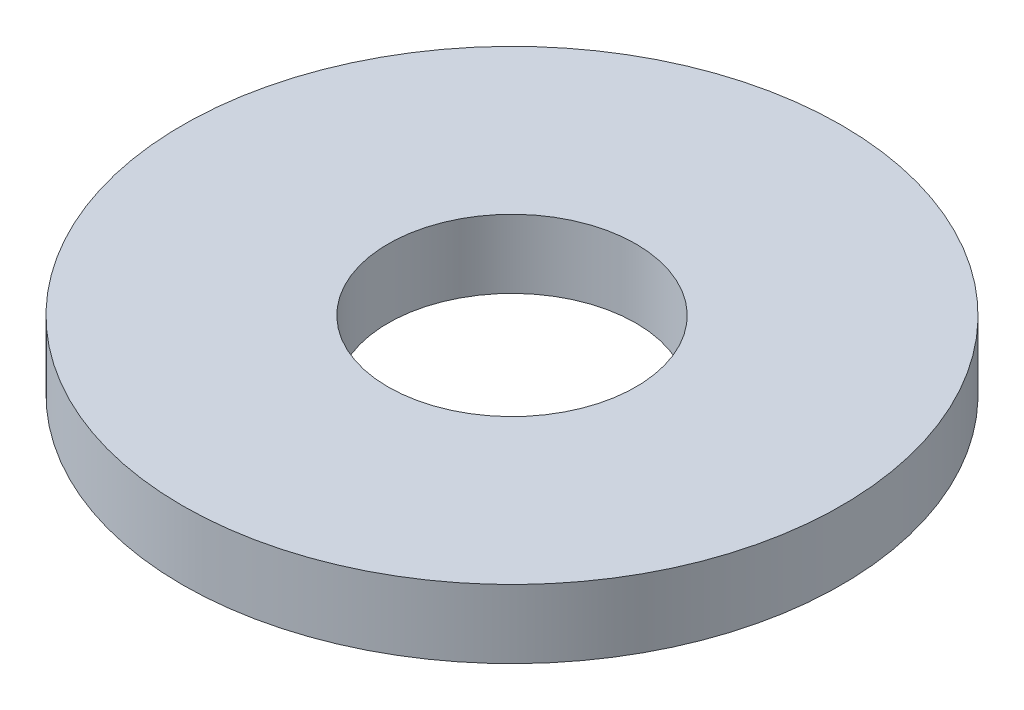
ISO-10303-21;
HEADER;
FILE_DESCRIPTION(('STEP AP214'),'2;1');
FILE_NAME('part.step','',(''),(''),'','','');
FILE_SCHEMA(('AUTOMOTIVE_DESIGN { 1 0 10303 214 1 1 1 1 }'));
ENDSEC;
DATA;
#1=APPLICATION_CONTEXT('core data for automotive mechanical design processes');
#2=APPLICATION_PROTOCOL_DEFINITION('international standard','automotive_design',2000,#1);
#3=PRODUCT_CONTEXT('',#1,'mechanical');
#4=PRODUCT('Part','Part','',(#3));
#5=PRODUCT_RELATED_PRODUCT_CATEGORY('part','',(#4));
#6=PRODUCT_DEFINITION_FORMATION('','',#4);
#7=PRODUCT_DEFINITION_CONTEXT('part definition',#1,'design');
#8=PRODUCT_DEFINITION('design','',#6,#7);
#9=PRODUCT_DEFINITION_SHAPE('','',#8);
#10=(LENGTH_UNIT() NAMED_UNIT(*) SI_UNIT(.MILLI.,.METRE.));
#11=(NAMED_UNIT(*) PLANE_ANGLE_UNIT() SI_UNIT($,.RADIAN.));
#12=(NAMED_UNIT(*) SI_UNIT($,.STERADIAN.) SOLID_ANGLE_UNIT());
#13=UNCERTAINTY_MEASURE_WITH_UNIT(LENGTH_MEASURE(1.E-05),#10,'distance_accuracy_value','');
#14=(GEOMETRIC_REPRESENTATION_CONTEXT(3) GLOBAL_UNCERTAINTY_ASSIGNED_CONTEXT((#13)) GLOBAL_UNIT_ASSIGNED_CONTEXT((#10,
#11,#12)) REPRESENTATION_CONTEXT('',''));
#15=CARTESIAN_POINT('',(0.,0.,0.));
#16=DIRECTION('',(0.,0.,1.));
#17=DIRECTION('',(1.,0.,0.));
#18=AXIS2_PLACEMENT_3D('',#15,#16,#17);
#19=CARTESIAN_POINT('',(0.,0.9906,0.));
#20=DIRECTION('',(0.,-1.,0.));
#21=DIRECTION('',(0.,0.,-1.));
#22=AXIS2_PLACEMENT_3D('',#19,#20,#21);
#23=CYLINDRICAL_SURFACE('',#22,4.7625);
#24=CARTESIAN_POINT('',(0.,0.9906,0.));
#25=DIRECTION('',(0.,1.,0.));
#26=DIRECTION('',(0.,0.,1.));
#27=AXIS2_PLACEMENT_3D('',#24,#25,#26);
#28=CIRCLE('',#27,4.7625);
#29=CARTESIAN_POINT('',(0.,0.9906,4.7625));
#30=VERTEX_POINT('',#29);
#31=EDGE_CURVE('E10',#30,#30,#28,.T.);
#32=ORIENTED_EDGE('',*,*,#31,.F.);
#33=EDGE_LOOP('',(#32));
#34=FACE_BOUND('',#33,.T.);
#35=CARTESIAN_POINT('',(0.,0.,0.));
#36=DIRECTION('',(0.,1.,0.));
#37=DIRECTION('',(0.,0.,1.));
#38=AXIS2_PLACEMENT_3D('',#35,#36,#37);
#39=CIRCLE('',#38,4.7625);
#40=CARTESIAN_POINT('',(0.,0.,4.7625));
#41=VERTEX_POINT('',#40);
#42=EDGE_CURVE('E33',#41,#41,#39,.T.);
#43=ORIENTED_EDGE('',*,*,#42,.T.);
#44=EDGE_LOOP('',(#43));
#45=FACE_BOUND('',#44,.T.);
#46=ADVANCED_FACE('F30',(#34,#45),#23,.T.);
#47=CARTESIAN_POINT('',(0.,0.9906,0.));
#48=DIRECTION('',(0.,1.,0.));
#49=DIRECTION('',(0.,0.,1.));
#50=AXIS2_PLACEMENT_3D('',#47,#48,#49);
#51=PLANE('',#50);
#52=CARTESIAN_POINT('',(0.,0.9906,0.));
#53=DIRECTION('',(0.,1.,0.));
#54=DIRECTION('',(0.,0.,1.));
#55=AXIS2_PLACEMENT_3D('',#52,#53,#54);
#56=CIRCLE('',#55,1.7907);
#57=CARTESIAN_POINT('',(0.,0.9906,1.7907));
#58=VERTEX_POINT('',#57);
#59=EDGE_CURVE('E42',#58,#58,#56,.T.);
#60=ORIENTED_EDGE('',*,*,#59,.F.);
#61=EDGE_LOOP('',(#60));
#62=FACE_BOUND('',#61,.T.);
#63=ORIENTED_EDGE('',*,*,#31,.T.);
#64=EDGE_LOOP('',(#63));
#65=FACE_BOUND('',#64,.T.);
#66=ADVANCED_FACE('F57',(#62,#65),#51,.T.);
#67=CARTESIAN_POINT('',(0.,0.,0.));
#68=DIRECTION('',(0.,1.,0.));
#69=DIRECTION('',(0.,0.,1.));
#70=AXIS2_PLACEMENT_3D('',#67,#68,#69);
#71=PLANE('',#70);
#72=CARTESIAN_POINT('',(0.,0.,0.));
#73=DIRECTION('',(0.,1.,0.));
#74=DIRECTION('',(0.,0.,1.));
#75=AXIS2_PLACEMENT_3D('',#72,#73,#74);
#76=CIRCLE('',#75,1.7907);
#77=CARTESIAN_POINT('',(0.,0.,1.7907));
#78=VERTEX_POINT('',#77);
#79=EDGE_CURVE('E40',#78,#78,#76,.T.);
#80=ORIENTED_EDGE('',*,*,#79,.T.);
#81=EDGE_LOOP('',(#80));
#82=FACE_BOUND('',#81,.T.);
#83=ORIENTED_EDGE('',*,*,#42,.F.);
#84=EDGE_LOOP('',(#83));
#85=FACE_BOUND('',#84,.T.);
#86=ADVANCED_FACE('F48',(#82,#85),#71,.F.);
#87=CARTESIAN_POINT('',(0.,0.,0.));
#88=DIRECTION('',(0.,1.,0.));
#89=DIRECTION('',(0.,0.,1.));
#90=AXIS2_PLACEMENT_3D('',#87,#88,#89);
#91=CYLINDRICAL_SURFACE('',#90,1.7907);
#92=ORIENTED_EDGE('',*,*,#79,.F.);
#93=EDGE_LOOP('',(#92));
#94=FACE_BOUND('',#93,.T.);
#95=ORIENTED_EDGE('',*,*,#59,.T.);
#96=EDGE_LOOP('',(#95));
#97=FACE_BOUND('',#96,.T.);
#98=ADVANCED_FACE('F51',(#94,#97),#91,.F.);
#99=CLOSED_SHELL('',(#46,#66,#86,#98));
#100=MANIFOLD_SOLID_BREP('B2',#99);
#101=ADVANCED_BREP_SHAPE_REPRESENTATION('',(#18,#100),#14);
#102=SHAPE_DEFINITION_REPRESENTATION(#9,#101);
ENDSEC;
END-ISO-10303-21;
